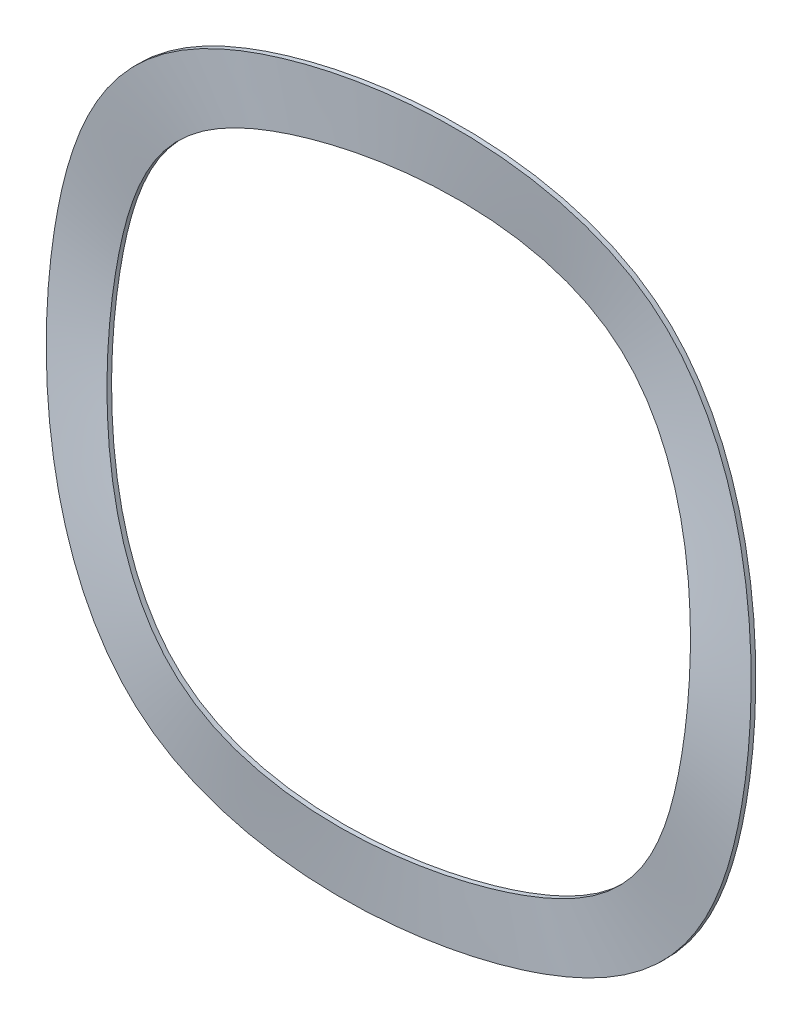
ISO-10303-21;
HEADER;
FILE_DESCRIPTION(('STEP AP214'),'2;1');
FILE_NAME('part.step','',(''),(''),'','','');
FILE_SCHEMA(('AUTOMOTIVE_DESIGN { 1 0 10303 214 1 1 1 1 }'));
ENDSEC;
DATA;
#1=APPLICATION_CONTEXT('core data for automotive mechanical design processes');
#2=APPLICATION_PROTOCOL_DEFINITION('international standard','automotive_design',2000,#1);
#3=PRODUCT_CONTEXT('',#1,'mechanical');
#4=PRODUCT('Part','Part','',(#3));
#5=PRODUCT_RELATED_PRODUCT_CATEGORY('part','',(#4));
#6=PRODUCT_DEFINITION_FORMATION('','',#4);
#7=PRODUCT_DEFINITION_CONTEXT('part definition',#1,'design');
#8=PRODUCT_DEFINITION('design','',#6,#7);
#9=PRODUCT_DEFINITION_SHAPE('','',#8);
#10=(LENGTH_UNIT() NAMED_UNIT(*) SI_UNIT(.MILLI.,.METRE.));
#11=(NAMED_UNIT(*) PLANE_ANGLE_UNIT() SI_UNIT($,.RADIAN.));
#12=(NAMED_UNIT(*) SI_UNIT($,.STERADIAN.) SOLID_ANGLE_UNIT());
#13=UNCERTAINTY_MEASURE_WITH_UNIT(LENGTH_MEASURE(1.E-05),#10,'distance_accuracy_value','');
#14=(GEOMETRIC_REPRESENTATION_CONTEXT(3) GLOBAL_UNCERTAINTY_ASSIGNED_CONTEXT((#13)) GLOBAL_UNIT_ASSIGNED_CONTEXT((#10,
#11,#12)) REPRESENTATION_CONTEXT('',''));
#15=CARTESIAN_POINT('',(0.,0.,0.));
#16=DIRECTION('',(0.,0.,1.));
#17=DIRECTION('',(1.,0.,0.));
#18=AXIS2_PLACEMENT_3D('',#15,#16,#17);
#19=CARTESIAN_POINT('',(4.10424171990796,-11.2763114494309,0.));
#20=CARTESIAN_POINT('',(4.29955316343247,-11.205223897577,-1.30383781570855E-13));
#21=CARTESIAN_POINT('',(4.68607180876146,-11.0517724824196,0.00674999999963001));
#22=CARTESIAN_POINT('',(5.25238003389747,-10.7891453053327,0.0350999999993307));
#23=CARTESIAN_POINT('',(5.80406149847858,-10.4954469538927,0.0796499999990883));
#24=CARTESIAN_POINT('',(9.01944761645147,-8.5551030791188,0.431999999997962));
#25=CARTESIAN_POINT('',(13.8528923057771,-1.59842884244762,2.43000000000089));
#26=CARTESIAN_POINT('',(9.25614157948982,11.0310399809181,-1.34999999999932));
#27=CARTESIAN_POINT('',(-4.92509006391954,13.5315737393022,2.7000000000019));
#28=CARTESIAN_POINT('',(-14.1812316433592,2.50053375843256,-1.35000000000291));
#29=CARTESIAN_POINT('',(-9.58448091711344,-10.1289350649399,2.4299999999972));
#30=CARTESIAN_POINT('',(-1.41018346773691,-12.3511783481163,0.432000000002617));
#31=CARTESIAN_POINT('',(2.30017420164897,-11.7707576341525,0.0796500000013851));
#32=CARTESIAN_POINT('',(2.91157238325626,-11.6411296143023,0.0351000000008826));
#33=CARTESIAN_POINT('',(3.51420314761442,-11.4782977935433,0.00675000000041226));
#34=CARTESIAN_POINT('',(3.90893027638345,-11.3473990012849,1.30457049920792E-13));
#35=CARTESIAN_POINT('',(4.10424171990796,-11.2763114494309,0.));
#36=CARTESIAN_POINT('',(3.87622829102418,-10.6498497022403,0.));
#37=CARTESIAN_POINT('',(4.06068909879732,-10.5827114588227,-1.30383781570855E-13));
#38=CARTESIAN_POINT('',(4.42573448605249,-10.4377851222852,0.00674999999963001));
#39=CARTESIAN_POINT('',(4.96058114312538,-10.1897483439254,0.0350999999993307));
#40=CARTESIAN_POINT('',(5.48161363745199,-9.9123665675653,0.0796499999990883));
#41=CARTESIAN_POINT('',(8.51836719331527,-8.07981957472331,0.431999999997962));
#42=CARTESIAN_POINT('',(13.0832871776784,-1.50962724008942,2.43000000000089));
#43=CARTESIAN_POINT('',(8.74191149174041,10.4182044264226,-1.34999999999932));
#44=CARTESIAN_POINT('',(-4.65147394925743,12.7798196426743,2.7000000000019));
#45=CARTESIAN_POINT('',(-13.3933854409503,2.36161521629742,-1.35000000000291));
#46=CARTESIAN_POINT('',(-9.05200975505158,-9.566216450221,2.4299999999972));
#47=CARTESIAN_POINT('',(-1.33183994175152,-11.6650017732209,0.432000000002617));
#48=CARTESIAN_POINT('',(2.1723867460018,-11.1168266544773,0.0796500000013851));
#49=CARTESIAN_POINT('',(2.74981836196424,-10.9944001912855,0.0351000000008826));
#50=CARTESIAN_POINT('',(3.31896963941361,-10.8406145827909,0.00675000000041226));
#51=CARTESIAN_POINT('',(3.69176748325103,-10.7169879456579,1.30457049920792E-13));
#52=CARTESIAN_POINT('',(3.87622829102418,-10.6498497022403,0.));
#53=CARTESIAN_POINT('',(3.6482148621404,-10.0233879550497,0.));
#54=CARTESIAN_POINT('',(3.82182503416219,-9.96019902006843,-1.3038208750496E-13));
#55=CARTESIAN_POINT('',(4.16539716334352,-9.82379776215076,0.00674999999963003));
#56=CARTESIAN_POINT('',(4.6687822523533,-9.59035138251799,0.0350999999993308));
#57=CARTESIAN_POINT('',(5.1591657764254,-9.32928618123793,0.0796499999990884));
#58=CARTESIAN_POINT('',(8.01728677017907,-7.60453607032782,0.431999999997962));
#59=CARTESIAN_POINT('',(12.3136820495797,-1.42082563773122,2.43000000000089));
#60=CARTESIAN_POINT('',(8.22768140399101,9.80536887192717,-1.34999999999932));
#61=CARTESIAN_POINT('',(-4.37785783459533,12.0280655460463,2.7000000000019));
#62=CARTESIAN_POINT('',(-12.6055392385414,2.22269667416229,-1.35000000000291));
#63=CARTESIAN_POINT('',(-8.51953859298972,-9.00349783550212,2.4299999999972));
#64=CARTESIAN_POINT('',(-1.25349641576614,-10.9788251983256,0.432000000002617));
#65=CARTESIAN_POINT('',(2.04459929035463,-10.4628956748022,0.0796500000013851));
#66=CARTESIAN_POINT('',(2.58806434067223,-10.3476707682687,0.0351000000008825));
#67=CARTESIAN_POINT('',(3.12373613121281,-10.2029313720385,0.00675000000041222));
#68=CARTESIAN_POINT('',(3.47460469011862,-10.086576890031,1.30438415195952E-13));
#69=CARTESIAN_POINT('',(3.6482148621404,-10.0233879550497,0.));
#70=CARTESIAN_POINT('',(3.42020143325662,-9.39692620785911,0.));
#71=CARTESIAN_POINT('',(3.58296096952704,-9.33768658131415,-1.3038208750496E-13));
#72=CARTESIAN_POINT('',(3.90505984063454,-9.20981040201634,0.00674999999963003));
#73=CARTESIAN_POINT('',(4.37698336158121,-8.99095442111061,0.0350999999993308));
#74=CARTESIAN_POINT('',(4.8367179153988,-8.74620579491056,0.0796499999990884));
#75=CARTESIAN_POINT('',(7.51620634704288,-7.12925256593233,0.431999999997962));
#76=CARTESIAN_POINT('',(11.5440769214809,-1.33202403537302,2.43000000000089));
#77=CARTESIAN_POINT('',(7.71345131624161,9.19253331743173,-1.34999999999932));
#78=CARTESIAN_POINT('',(-4.10424171993323,11.2763114494184,2.7000000000019));
#79=CARTESIAN_POINT('',(-11.8176930361326,2.08377813202716,-1.35000000000291));
#80=CARTESIAN_POINT('',(-7.98706743092786,-8.44077922078324,2.4299999999972));
#81=CARTESIAN_POINT('',(-1.17515288978076,-10.2926486234302,0.432000000002617));
#82=CARTESIAN_POINT('',(1.91681183470747,-9.80896469512705,0.0796500000013851));
#83=CARTESIAN_POINT('',(2.42631031938021,-9.7009413452519,0.0351000000008825));
#84=CARTESIAN_POINT('',(2.928502623012,-9.56524816128607,0.00675000000041222));
#85=CARTESIAN_POINT('',(3.2574418969862,-9.45616583440406,1.30438415195952E-13));
#86=CARTESIAN_POINT('',(3.42020143325662,-9.39692620785911,0.));
#87=B_SPLINE_SURFACE_WITH_KNOTS('',3,3,((#19,#20,#21,#22,#23,#24,#25,#26,#27,#28,#29,#30,#31,
#32,#33,#34,#35),(#36,#37,#38,#39,#40,#41,#42,#43,#44,#45,#46,#47,#48,#49,#50,#51,#52),(#53,#54,
#55,#56,#57,#58,#59,#60,#61,#62,#63,#64,#65,#66,#67,#68,#69),(#70,#71,#72,#73,#74,#75,#76,#77,
#78,#79,#80,#81,#82,#83,#84,#85,#86)),.UNSPECIFIED.,.F.,.T.,.F.,(4,4),(4,1,1,1,1,1,1,1,1,1,1,1,
1,1,4),(0.,1.),(0.,0.0083333333333333,0.0166666666666668,0.0250000000000001,0.0333333333333337,
0.166666666666674,0.333333333333348,0.50000000000004,0.666666666667411,0.833333333334139,
0.966666666666667,0.975,0.983333333333334,0.991666666666667,1.),.UNSPECIFIED.);
#88=CARTESIAN_POINT('',(4.10424171990796,-11.2763114494309,0.));
#89=CARTESIAN_POINT('',(4.29955316343247,-11.205223897577,-1.30383781570855E-13));
#90=CARTESIAN_POINT('',(4.68607180876146,-11.0517724824196,0.00674999999963001));
#91=CARTESIAN_POINT('',(5.25238003389747,-10.7891453053327,0.0350999999993307));
#92=CARTESIAN_POINT('',(5.80406149847858,-10.4954469538927,0.0796499999990883));
#93=CARTESIAN_POINT('',(9.01944761645147,-8.5551030791188,0.431999999997962));
#94=CARTESIAN_POINT('',(13.8528923057771,-1.59842884244762,2.43000000000089));
#95=CARTESIAN_POINT('',(9.25614157948982,11.0310399809181,-1.34999999999932));
#96=CARTESIAN_POINT('',(-4.92509006391954,13.5315737393022,2.7000000000019));
#97=CARTESIAN_POINT('',(-14.1812316433592,2.50053375843256,-1.35000000000291));
#98=CARTESIAN_POINT('',(-9.58448091711344,-10.1289350649399,2.4299999999972));
#99=CARTESIAN_POINT('',(-1.41018346773691,-12.3511783481163,0.432000000002617));
#100=CARTESIAN_POINT('',(2.30017420164897,-11.7707576341525,0.0796500000013851));
#101=CARTESIAN_POINT('',(2.91157238325626,-11.6411296143023,0.0351000000008826));
#102=CARTESIAN_POINT('',(3.51420314761442,-11.4782977935433,0.00675000000041226));
#103=CARTESIAN_POINT('',(3.90893027638345,-11.3473990012849,1.30457049920792E-13));
#104=CARTESIAN_POINT('',(4.10424171990796,-11.2763114494309,0.));
#105=B_SPLINE_CURVE_WITH_KNOTS('',3,(#88,#89,#90,#91,#92,#93,#94,#95,#96,#97,#98,#99,#100,#101,
#102,#103,#104),.UNSPECIFIED.,.T.,.F.,(4,1,1,1,1,1,1,1,1,1,1,1,1,1,4),(0.,0.0083333333333333,
0.0166666666666668,0.0250000000000001,0.0333333333333337,0.166666666666674,0.333333333333348,
0.50000000000004,0.666666666667411,0.833333333334139,0.966666666666667,0.975,0.983333333333334,
0.991666666666667,1.),.UNSPECIFIED.);
#106=CARTESIAN_POINT('',(4.10424171990796,-11.2763114494309,0.));
#107=VERTEX_POINT('',#106);
#108=EDGE_CURVE('E11',#107,#107,#105,.F.);
#109=CARTESIAN_POINT('',(3.42020143325662,-9.39692620785911,0.));
#110=CARTESIAN_POINT('',(3.58296096952704,-9.33768658131415,-1.3038208750496E-13));
#111=CARTESIAN_POINT('',(3.90505984063454,-9.20981040201634,0.00674999999963003));
#112=CARTESIAN_POINT('',(4.37698336158121,-8.99095442111061,0.0350999999993308));
#113=CARTESIAN_POINT('',(4.8367179153988,-8.74620579491056,0.0796499999990884));
#114=CARTESIAN_POINT('',(7.51620634704288,-7.12925256593233,0.431999999997962));
#115=CARTESIAN_POINT('',(11.5440769214809,-1.33202403537302,2.43000000000089));
#116=CARTESIAN_POINT('',(7.71345131624161,9.19253331743173,-1.34999999999932));
#117=CARTESIAN_POINT('',(-4.10424171993323,11.2763114494184,2.7000000000019));
#118=CARTESIAN_POINT('',(-11.8176930361326,2.08377813202716,-1.35000000000291));
#119=CARTESIAN_POINT('',(-7.98706743092786,-8.44077922078324,2.4299999999972));
#120=CARTESIAN_POINT('',(-1.17515288978076,-10.2926486234302,0.432000000002617));
#121=CARTESIAN_POINT('',(1.91681183470747,-9.80896469512705,0.0796500000013851));
#122=CARTESIAN_POINT('',(2.42631031938021,-9.7009413452519,0.0351000000008825));
#123=CARTESIAN_POINT('',(2.928502623012,-9.56524816128607,0.00675000000041222));
#124=CARTESIAN_POINT('',(3.2574418969862,-9.45616583440406,1.30438415195952E-13));
#125=CARTESIAN_POINT('',(3.42020143325662,-9.39692620785911,0.));
#126=B_SPLINE_CURVE_WITH_KNOTS('',3,(#109,#110,#111,#112,#113,#114,#115,#116,#117,#118,#119,
#120,#121,#122,#123,#124,#125),.UNSPECIFIED.,.T.,.F.,(4,1,1,1,1,1,1,1,1,1,1,1,1,1,4),(0.,
0.0083333333333333,0.0166666666666668,0.0250000000000001,0.0333333333333337,0.166666666666674,
0.333333333333348,0.50000000000004,0.666666666667411,0.833333333334139,0.966666666666667,0.975,
0.983333333333334,0.991666666666667,1.),.UNSPECIFIED.);
#127=CARTESIAN_POINT('',(3.42020143325662,-9.39692620785911,0.));
#128=VERTEX_POINT('',#127);
#129=EDGE_CURVE('E63',#128,#128,#126,.T.);
#130=ORIENTED_EDGE('',*,*,#108,.T.);
#131=EDGE_LOOP('',(#130));
#132=FACE_BOUND('',#131,.T.);
#133=ORIENTED_EDGE('',*,*,#129,.T.);
#134=EDGE_LOOP('',(#133));
#135=FACE_BOUND('',#134,.T.);
#136=ADVANCED_FACE('F51',(#132,#135),#87,.T.);
#137=CARTESIAN_POINT('',(4.10424171990796,-11.2763114494309,0.15));
#138=CARTESIAN_POINT('',(4.29955316343247,-11.205223897577,0.14999999999987));
#139=CARTESIAN_POINT('',(4.68607180876146,-11.0517724824196,0.15674999999963));
#140=CARTESIAN_POINT('',(5.25238003389747,-10.7891453053327,0.185099999999331));
#141=CARTESIAN_POINT('',(5.80406149847858,-10.4954469538927,0.229649999999088));
#142=CARTESIAN_POINT('',(9.01944761645146,-8.5551030791188,0.581999999997962));
#143=CARTESIAN_POINT('',(13.8528923057771,-1.59842884244763,2.58000000000088));
#144=CARTESIAN_POINT('',(9.25614157948994,11.0310399809181,-1.19999999999932));
#145=CARTESIAN_POINT('',(-4.92509006391999,13.531573739302,2.8500000000019));
#146=CARTESIAN_POINT('',(-14.1812316433591,2.5005337584326,-1.20000000000291));
#147=CARTESIAN_POINT('',(-9.58448091711347,-10.1289350649399,2.5799999999972));
#148=CARTESIAN_POINT('',(-1.41018346773691,-12.3511783481163,0.582000000002617));
#149=CARTESIAN_POINT('',(2.30017420164897,-11.7707576341525,0.229650000001385));
#150=CARTESIAN_POINT('',(2.91157238325626,-11.6411296143023,0.185100000000882));
#151=CARTESIAN_POINT('',(3.51420314761442,-11.4782977935433,0.156750000000412));
#152=CARTESIAN_POINT('',(3.90893027638345,-11.3473990012849,0.15000000000013));
#153=CARTESIAN_POINT('',(4.10424171990796,-11.2763114494309,0.15));
#154=CARTESIAN_POINT('',(4.10424171990796,-11.2763114494309,0.1375));
#155=CARTESIAN_POINT('',(4.29955316343247,-11.205223897577,0.13749999999987));
#156=CARTESIAN_POINT('',(4.68607180876146,-11.0517724824196,0.14424999999963));
#157=CARTESIAN_POINT('',(5.25238003389747,-10.7891453053327,0.172599999999331));
#158=CARTESIAN_POINT('',(5.80406149847858,-10.4954469538927,0.217149999999088));
#159=CARTESIAN_POINT('',(9.01944761645146,-8.5551030791188,0.569499999997962));
#160=CARTESIAN_POINT('',(13.8528923057771,-1.59842884244763,2.56750000000088));
#161=CARTESIAN_POINT('',(9.25614157948993,11.0310399809181,-1.21249999999932));
#162=CARTESIAN_POINT('',(-4.92509006391995,13.531573739302,2.8375000000019));
#163=CARTESIAN_POINT('',(-14.1812316433591,2.5005337584326,-1.21250000000291));
#164=CARTESIAN_POINT('',(-9.58448091711347,-10.1289350649399,2.5674999999972));
#165=CARTESIAN_POINT('',(-1.41018346773691,-12.3511783481163,0.569500000002617));
#166=CARTESIAN_POINT('',(2.30017420164897,-11.7707576341525,0.217150000001385));
#167=CARTESIAN_POINT('',(2.91157238325626,-11.6411296143023,0.172600000000883));
#168=CARTESIAN_POINT('',(3.51420314761442,-11.4782977935433,0.144250000000412));
#169=CARTESIAN_POINT('',(3.90893027638345,-11.3473990012849,0.13750000000013));
#170=CARTESIAN_POINT('',(4.10424171990796,-11.2763114494309,0.1375));
#171=CARTESIAN_POINT('',(4.10424171990796,-11.2763114494309,0.1125));
#172=CARTESIAN_POINT('',(4.29955316343246,-11.205223897577,0.112499999999869));
#173=CARTESIAN_POINT('',(4.68607180876146,-11.0517724824196,0.11924999999963));
#174=CARTESIAN_POINT('',(5.25238003389747,-10.7891453053327,0.147599999999331));
#175=CARTESIAN_POINT('',(5.80406149847858,-10.4954469538927,0.192149999999088));
#176=CARTESIAN_POINT('',(9.01944761645147,-8.5551030791188,0.544499999997962));
#177=CARTESIAN_POINT('',(13.8528923057771,-1.59842884244763,2.54250000000089));
#178=CARTESIAN_POINT('',(9.25614157948989,11.0310399809181,-1.23749999999932));
#179=CARTESIAN_POINT('',(-4.92509006391986,13.5315737393021,2.8125000000019));
#180=CARTESIAN_POINT('',(-14.1812316433591,2.50053375843259,-1.23750000000291));
#181=CARTESIAN_POINT('',(-9.58448091711347,-10.1289350649399,2.5424999999972));
#182=CARTESIAN_POINT('',(-1.41018346773691,-12.3511783481163,0.544500000002617));
#183=CARTESIAN_POINT('',(2.30017420164897,-11.7707576341525,0.192150000001385));
#184=CARTESIAN_POINT('',(2.91157238325626,-11.6411296143023,0.147600000000882));
#185=CARTESIAN_POINT('',(3.51420314761442,-11.4782977935433,0.119250000000412));
#186=CARTESIAN_POINT('',(3.90893027638345,-11.3473990012849,0.11250000000013));
#187=CARTESIAN_POINT('',(4.10424171990796,-11.2763114494309,0.1125));
#188=CARTESIAN_POINT('',(4.10424171990796,-11.2763114494309,0.0750000000000003));
#189=CARTESIAN_POINT('',(4.29955316343247,-11.205223897577,0.0749999999998699));
#190=CARTESIAN_POINT('',(4.68607180876146,-11.0517724824196,0.0817499999996303));
#191=CARTESIAN_POINT('',(5.25238003389747,-10.7891453053327,0.110099999999331));
#192=CARTESIAN_POINT('',(5.80406149847858,-10.4954469538927,0.154649999999089));
#193=CARTESIAN_POINT('',(9.01944761645147,-8.5551030791188,0.506999999997962));
#194=CARTESIAN_POINT('',(13.8528923057771,-1.59842884244762,2.50500000000089));
#195=CARTESIAN_POINT('',(9.2561415794899,11.0310399809181,-1.27499999999932));
#196=CARTESIAN_POINT('',(-4.92509006391978,13.5315737393021,2.7750000000019));
#197=CARTESIAN_POINT('',(-14.1812316433591,2.50053375843258,-1.27500000000291));
#198=CARTESIAN_POINT('',(-9.58448091711345,-10.1289350649399,2.5049999999972));
#199=CARTESIAN_POINT('',(-1.41018346773691,-12.3511783481163,0.507000000002617));
#200=CARTESIAN_POINT('',(2.30017420164897,-11.7707576341525,0.154650000001385));
#201=CARTESIAN_POINT('',(2.91157238325626,-11.6411296143023,0.110100000000883));
#202=CARTESIAN_POINT('',(3.51420314761442,-11.4782977935433,0.0817500000004125));
#203=CARTESIAN_POINT('',(3.90893027638345,-11.3473990012849,0.0750000000001307));
#204=CARTESIAN_POINT('',(4.10424171990796,-11.2763114494309,0.0750000000000003));
#205=CARTESIAN_POINT('',(4.10424171990796,-11.2763114494309,0.0375000000000001));
#206=CARTESIAN_POINT('',(4.29955316343246,-11.205223897577,0.0374999999998697));
#207=CARTESIAN_POINT('',(4.68607180876146,-11.0517724824196,0.0442499999996301));
#208=CARTESIAN_POINT('',(5.25238003389747,-10.7891453053327,0.0725999999993308));
#209=CARTESIAN_POINT('',(5.80406149847858,-10.4954469538927,0.117149999999088));
#210=CARTESIAN_POINT('',(9.01944761645146,-8.55510307911879,0.469499999997962));
#211=CARTESIAN_POINT('',(13.8528923057771,-1.59842884244764,2.46750000000089));
#212=CARTESIAN_POINT('',(9.25614157948983,11.0310399809181,-1.31249999999932));
#213=CARTESIAN_POINT('',(-4.92509006391964,13.5315737393021,2.7375000000019));
#214=CARTESIAN_POINT('',(-14.1812316433591,2.50053375843257,-1.31250000000291));
#215=CARTESIAN_POINT('',(-9.58448091711345,-10.1289350649399,2.46749999999719));
#216=CARTESIAN_POINT('',(-1.41018346773691,-12.3511783481163,0.469500000002617));
#217=CARTESIAN_POINT('',(2.30017420164897,-11.7707576341524,0.117150000001385));
#218=CARTESIAN_POINT('',(2.91157238325626,-11.6411296143023,0.0726000000008825));
#219=CARTESIAN_POINT('',(3.51420314761442,-11.4782977935433,0.0442500000004122));
#220=CARTESIAN_POINT('',(3.90893027638345,-11.3473990012849,0.0375000000001305));
#221=CARTESIAN_POINT('',(4.10424171990796,-11.2763114494309,0.0375000000000001));
#222=CARTESIAN_POINT('',(4.10424171990796,-11.2763114494309,0.0125000000000001));
#223=CARTESIAN_POINT('',(4.29955316343247,-11.205223897577,0.0124999999998696));
#224=CARTESIAN_POINT('',(4.68607180876146,-11.0517724824196,0.0192499999996301));
#225=CARTESIAN_POINT('',(5.25238003389747,-10.7891453053327,0.0475999999993308));
#226=CARTESIAN_POINT('',(5.80406149847858,-10.4954469538927,0.0921499999990884));
#227=CARTESIAN_POINT('',(9.01944761645147,-8.5551030791188,0.444499999997962));
#228=CARTESIAN_POINT('',(13.8528923057771,-1.59842884244763,2.44250000000089));
#229=CARTESIAN_POINT('',(9.25614157948983,11.0310399809181,-1.33749999999932));
#230=CARTESIAN_POINT('',(-4.92509006391957,13.5315737393022,2.7125000000019));
#231=CARTESIAN_POINT('',(-14.1812316433592,2.50053375843256,-1.33750000000291));
#232=CARTESIAN_POINT('',(-9.58448091711345,-10.1289350649399,2.4424999999972));
#233=CARTESIAN_POINT('',(-1.41018346773691,-12.3511783481163,0.444500000002617));
#234=CARTESIAN_POINT('',(2.30017420164897,-11.7707576341525,0.0921500000013851));
#235=CARTESIAN_POINT('',(2.91157238325626,-11.6411296143023,0.0476000000008826));
#236=CARTESIAN_POINT('',(3.51420314761442,-11.4782977935433,0.0192500000004123));
#237=CARTESIAN_POINT('',(3.90893027638345,-11.3473990012849,0.0125000000001305));
#238=CARTESIAN_POINT('',(4.10424171990796,-11.2763114494309,0.0125000000000001));
#239=CARTESIAN_POINT('',(4.10424171990796,-11.2763114494309,0.));
#240=CARTESIAN_POINT('',(4.29955316343247,-11.205223897577,-1.30383781570855E-13));
#241=CARTESIAN_POINT('',(4.68607180876146,-11.0517724824196,0.00674999999963001));
#242=CARTESIAN_POINT('',(5.25238003389747,-10.7891453053327,0.0350999999993307));
#243=CARTESIAN_POINT('',(5.80406149847858,-10.4954469538927,0.0796499999990883));
#244=CARTESIAN_POINT('',(9.01944761645147,-8.5551030791188,0.431999999997962));
#245=CARTESIAN_POINT('',(13.8528923057771,-1.59842884244762,2.43000000000089));
#246=CARTESIAN_POINT('',(9.25614157948982,11.0310399809181,-1.34999999999932));
#247=CARTESIAN_POINT('',(-4.92509006391954,13.5315737393022,2.7000000000019));
#248=CARTESIAN_POINT('',(-14.1812316433592,2.50053375843256,-1.35000000000291));
#249=CARTESIAN_POINT('',(-9.58448091711344,-10.1289350649399,2.4299999999972));
#250=CARTESIAN_POINT('',(-1.41018346773691,-12.3511783481163,0.432000000002617));
#251=CARTESIAN_POINT('',(2.30017420164897,-11.7707576341525,0.0796500000013851));
#252=CARTESIAN_POINT('',(2.91157238325626,-11.6411296143023,0.0351000000008826));
#253=CARTESIAN_POINT('',(3.51420314761442,-11.4782977935433,0.00675000000041226));
#254=CARTESIAN_POINT('',(3.90893027638345,-11.3473990012849,1.30457049920792E-13));
#255=CARTESIAN_POINT('',(4.10424171990796,-11.2763114494309,0.));
#256=B_SPLINE_SURFACE_WITH_KNOTS('',3,3,((#137,#138,#139,#140,#141,#142,#143,#144,#145,#146,
#147,#148,#149,#150,#151,#152,#153),(#154,#155,#156,#157,#158,#159,#160,#161,#162,#163,#164,
#165,#166,#167,#168,#169,#170),(#171,#172,#173,#174,#175,#176,#177,#178,#179,#180,#181,#182,
#183,#184,#185,#186,#187),(#188,#189,#190,#191,#192,#193,#194,#195,#196,#197,#198,#199,#200,
#201,#202,#203,#204),(#205,#206,#207,#208,#209,#210,#211,#212,#213,#214,#215,#216,#217,#218,
#219,#220,#221),(#222,#223,#224,#225,#226,#227,#228,#229,#230,#231,#232,#233,#234,#235,#236,
#237,#238),(#239,#240,#241,#242,#243,#244,#245,#246,#247,#248,#249,#250,#251,#252,#253,#254,
#255)),.UNSPECIFIED.,.F.,.T.,.F.,(4,1,1,1,4),(4,1,1,1,1,1,1,1,1,1,1,1,1,1,4),(0.934782608695652,
0.951086956521739,0.967391304347826,0.983695652173913,1.),(0.,0.0083333333333333,
0.0166666666666668,0.0250000000000001,0.0333333333333337,0.166666666666674,0.333333333333348,
0.50000000000004,0.666666666667411,0.833333333334139,0.966666666666667,0.975,0.983333333333334,
0.991666666666667,1.),.UNSPECIFIED.);
#257=CARTESIAN_POINT('',(4.10424171990796,-11.2763114494309,0.15));
#258=CARTESIAN_POINT('',(4.29955316343247,-11.205223897577,0.14999999999987));
#259=CARTESIAN_POINT('',(4.68607180876146,-11.0517724824196,0.15674999999963));
#260=CARTESIAN_POINT('',(5.25238003389747,-10.7891453053327,0.185099999999331));
#261=CARTESIAN_POINT('',(5.80406149847858,-10.4954469538927,0.229649999999088));
#262=CARTESIAN_POINT('',(9.01944761645146,-8.5551030791188,0.581999999997962));
#263=CARTESIAN_POINT('',(13.8528923057771,-1.59842884244763,2.58000000000088));
#264=CARTESIAN_POINT('',(9.25614157948994,11.0310399809181,-1.19999999999932));
#265=CARTESIAN_POINT('',(-4.92509006391999,13.531573739302,2.8500000000019));
#266=CARTESIAN_POINT('',(-14.1812316433591,2.5005337584326,-1.20000000000291));
#267=CARTESIAN_POINT('',(-9.58448091711347,-10.1289350649399,2.5799999999972));
#268=CARTESIAN_POINT('',(-1.41018346773691,-12.3511783481163,0.582000000002617));
#269=CARTESIAN_POINT('',(2.30017420164897,-11.7707576341525,0.229650000001385));
#270=CARTESIAN_POINT('',(2.91157238325626,-11.6411296143023,0.185100000000882));
#271=CARTESIAN_POINT('',(3.51420314761442,-11.4782977935433,0.156750000000412));
#272=CARTESIAN_POINT('',(3.90893027638345,-11.3473990012849,0.15000000000013));
#273=CARTESIAN_POINT('',(4.10424171990796,-11.2763114494309,0.15));
#274=B_SPLINE_CURVE_WITH_KNOTS('',3,(#257,#258,#259,#260,#261,#262,#263,#264,#265,#266,#267,
#268,#269,#270,#271,#272,#273),.UNSPECIFIED.,.T.,.F.,(4,1,1,1,1,1,1,1,1,1,1,1,1,1,4),(0.,
0.0083333333333333,0.0166666666666668,0.0250000000000001,0.0333333333333337,0.166666666666674,
0.333333333333348,0.50000000000004,0.666666666667411,0.833333333334139,0.966666666666667,0.975,
0.983333333333334,0.991666666666667,1.),.UNSPECIFIED.);
#275=CARTESIAN_POINT('',(4.10424171990796,-11.2763114494309,0.15));
#276=VERTEX_POINT('',#275);
#277=EDGE_CURVE('E57',#276,#276,#274,.T.);
#278=ORIENTED_EDGE('',*,*,#108,.F.);
#279=EDGE_LOOP('',(#278));
#280=FACE_BOUND('',#279,.T.);
#281=ORIENTED_EDGE('',*,*,#277,.F.);
#282=EDGE_LOOP('',(#281));
#283=FACE_BOUND('',#282,.T.);
#284=ADVANCED_FACE('F53',(#280,#283),#256,.T.);
#285=CARTESIAN_POINT('',(3.42020143325662,-9.39692620785911,0.15));
#286=CARTESIAN_POINT('',(3.58296096952705,-9.33768658131415,0.149999999999869));
#287=CARTESIAN_POINT('',(3.90505984063454,-9.20981040201634,0.15674999999963));
#288=CARTESIAN_POINT('',(4.37698336158121,-8.99095442111061,0.185099999999331));
#289=CARTESIAN_POINT('',(4.83671791539881,-8.74620579491056,0.229649999999088));
#290=CARTESIAN_POINT('',(7.51620634704288,-7.12925256593233,0.581999999997962));
#291=CARTESIAN_POINT('',(11.5440769214809,-1.33202403537302,2.58000000000089));
#292=CARTESIAN_POINT('',(7.7134513162416,9.19253331743173,-1.19999999999932));
#293=CARTESIAN_POINT('',(-4.10424171993323,11.2763114494184,2.8500000000019));
#294=CARTESIAN_POINT('',(-11.8176930361326,2.08377813202716,-1.20000000000291));
#295=CARTESIAN_POINT('',(-7.98706743092786,-8.44077922078324,2.5799999999972));
#296=CARTESIAN_POINT('',(-1.17515288978076,-10.2926486234302,0.582000000002617));
#297=CARTESIAN_POINT('',(1.91681183470747,-9.80896469512705,0.229650000001385));
#298=CARTESIAN_POINT('',(2.42631031938021,-9.7009413452519,0.185100000000882));
#299=CARTESIAN_POINT('',(2.92850262301201,-9.56524816128607,0.156750000000412));
#300=CARTESIAN_POINT('',(3.2574418969862,-9.45616583440406,0.15000000000013));
#301=CARTESIAN_POINT('',(3.42020143325662,-9.39692620785911,0.15));
#302=CARTESIAN_POINT('',(3.47720479047757,-9.55354164465676,0.15));
#303=CARTESIAN_POINT('',(3.64267698568583,-9.49331469100272,0.14999999999987));
#304=CARTESIAN_POINT('',(3.97014417131179,-9.36330724204995,0.15674999999963));
#305=CARTESIAN_POINT('',(4.44993308427423,-9.14080366146246,0.185099999999331));
#306=CARTESIAN_POINT('',(4.91732988065545,-8.8919758914924,0.229649999999088));
#307=CARTESIAN_POINT('',(7.64147645282693,-7.24807344203121,0.581999999997962));
#308=CARTESIAN_POINT('',(11.7364782035056,-1.35422443596257,2.58000000000089));
#309=CARTESIAN_POINT('',(7.84200883817897,9.34574220605559,-1.19999999999932));
#310=CARTESIAN_POINT('',(-4.1726457485988,11.4642499735754,2.8500000000019));
#311=CARTESIAN_POINT('',(-12.0146545867348,2.11850776756095,-1.20000000000291));
#312=CARTESIAN_POINT('',(-8.12018522144333,-8.58145887446296,2.5799999999972));
#313=CARTESIAN_POINT('',(-1.1947387712771,-10.4641927671541,0.582000000002617));
#314=CARTESIAN_POINT('',(1.94875869861926,-9.97244744004583,0.229650000001385));
#315=CARTESIAN_POINT('',(2.46674882470321,-9.8626237010061,0.185100000000882));
#316=CARTESIAN_POINT('',(2.97731100006221,-9.72466896397418,0.156750000000412));
#317=CARTESIAN_POINT('',(3.31173259526931,-9.6137685983108,0.15000000000013));
#318=CARTESIAN_POINT('',(3.47720479047757,-9.55354164465676,0.15));
#319=CARTESIAN_POINT('',(3.59121150491946,-9.86677251825208,0.15));
#320=CARTESIAN_POINT('',(3.7621090180034,-9.80457091037987,0.14999999999987));
#321=CARTESIAN_POINT('',(4.10031283266628,-9.67030092211717,0.15674999999963));
#322=CARTESIAN_POINT('',(4.59583252966028,-9.44050214216615,0.185099999999331));
#323=CARTESIAN_POINT('',(5.07855381116875,-9.1835160846561,0.229649999999089));
#324=CARTESIAN_POINT('',(7.89201666439503,-7.48571519422896,0.581999999997962));
#325=CARTESIAN_POINT('',(12.121280767555,-1.39862523714167,2.58000000000089));
#326=CARTESIAN_POINT('',(8.09912388205367,9.65215998330333,-1.19999999999932));
#327=CARTESIAN_POINT('',(-4.30945380592991,11.8401270218893,2.8500000000019));
#328=CARTESIAN_POINT('',(-12.4085776879392,2.18796703862853,-1.20000000000291));
#329=CARTESIAN_POINT('',(-8.38642080247426,-8.86281818182242,2.5799999999972));
#330=CARTESIAN_POINT('',(-1.2339105342698,-10.8072810546018,0.582000000002618));
#331=CARTESIAN_POINT('',(2.01265242644285,-10.2994129298834,0.229650000001385));
#332=CARTESIAN_POINT('',(2.54762583534922,-10.1859884125145,0.185100000000883));
#333=CARTESIAN_POINT('',(3.07492775416261,-10.0435105693504,0.156750000000413));
#334=CARTESIAN_POINT('',(3.42031399183552,-9.92897412612428,0.150000000000131));
#335=CARTESIAN_POINT('',(3.59121150491946,-9.86677251825208,0.15));
#336=CARTESIAN_POINT('',(3.76222157658229,-10.336618828645,0.15));
#337=CARTESIAN_POINT('',(3.94125706647975,-10.2714552394456,0.149999999999869));
#338=CARTESIAN_POINT('',(4.295565824698,-10.130791442218,0.15674999999963));
#339=CARTESIAN_POINT('',(4.81468169773934,-9.89004986322166,0.185099999999331));
#340=CARTESIAN_POINT('',(5.32038970693869,-9.6208263744016,0.229649999999088));
#341=CARTESIAN_POINT('',(8.26782698174716,-7.84217782252556,0.581999999997962));
#342=CARTESIAN_POINT('',(12.698484613629,-1.46522643891033,2.58000000000088));
#343=CARTESIAN_POINT('',(8.48479644786579,10.1117866491749,-1.19999999999932));
#344=CARTESIAN_POINT('',(-4.51466589192662,12.4039425943602,2.8500000000019));
#345=CARTESIAN_POINT('',(-12.9994623397458,2.29215594522988,-1.20000000000291));
#346=CARTESIAN_POINT('',(-8.78577417402068,-9.28485714286156,2.57999999999719));
#347=CARTESIAN_POINT('',(-1.29266817875884,-11.3219134857733,0.582000000002615));
#348=CARTESIAN_POINT('',(2.10849301817822,-10.7898611646397,0.229650000001384));
#349=CARTESIAN_POINT('',(2.66894135131823,-10.6710354797771,0.185100000000882));
#350=CARTESIAN_POINT('',(3.22135288531321,-10.5217729774147,0.156750000000412));
#351=CARTESIAN_POINT('',(3.58318608668482,-10.4017824178445,0.15000000000013));
#352=CARTESIAN_POINT('',(3.76222157658229,-10.336618828645,0.15));
#353=CARTESIAN_POINT('',(3.93323164824513,-10.806465139038,0.15));
#354=CARTESIAN_POINT('',(4.12040511495611,-10.7383395685113,0.14999999999987));
#355=CARTESIAN_POINT('',(4.49081881672974,-10.5912819623188,0.15674999999963));
#356=CARTESIAN_POINT('',(5.03353086581841,-10.3395975842772,0.185099999999331));
#357=CARTESIAN_POINT('',(5.56222560270864,-10.0581366641472,0.229649999999088));
#358=CARTESIAN_POINT('',(8.64363729909933,-8.19864045082219,0.581999999997961));
#359=CARTESIAN_POINT('',(13.2756884597031,-1.53182764067898,2.58000000000089));
#360=CARTESIAN_POINT('',(8.87046901367784,10.5714133150465,-1.19999999999932));
#361=CARTESIAN_POINT('',(-4.71987797792329,12.9677581668311,2.8500000000019));
#362=CARTESIAN_POINT('',(-13.5903469915525,2.39634485183124,-1.20000000000291));
#363=CARTESIAN_POINT('',(-9.18512754556705,-9.70689610390072,2.5799999999972));
#364=CARTESIAN_POINT('',(-1.35142582324787,-11.8365459169448,0.582000000002618));
#365=CARTESIAN_POINT('',(2.2043336099136,-11.2803093993961,0.229650000001386));
#366=CARTESIAN_POINT('',(2.79025686728725,-11.1560825470397,0.185100000000883));
#367=CARTESIAN_POINT('',(3.36777801646382,-11.000035385479,0.156750000000412));
#368=CARTESIAN_POINT('',(3.74605818153414,-10.8745907095647,0.150000000000131));
#369=CARTESIAN_POINT('',(3.93323164824513,-10.806465139038,0.15));
#370=CARTESIAN_POINT('',(4.04723836268701,-11.1196960126333,0.15));
#371=CARTESIAN_POINT('',(4.23983714727368,-11.0495957878884,0.14999999999987));
#372=CARTESIAN_POINT('',(4.62098747808422,-10.898275642386,0.15674999999963));
#373=CARTESIAN_POINT('',(5.17943031120445,-10.6392960649809,0.185099999999331));
#374=CARTESIAN_POINT('',(5.72344953322193,-10.3496768573108,0.229649999999088));
#375=CARTESIAN_POINT('',(8.89417751066742,-8.43628220301993,0.581999999997962));
#376=CARTESIAN_POINT('',(13.6604910237524,-1.57622844185808,2.58000000000089));
#377=CARTESIAN_POINT('',(9.12758405755258,10.8778310922942,-1.19999999999932));
#378=CARTESIAN_POINT('',(-4.85668603525442,13.3436352151451,2.8500000000019));
#379=CARTESIAN_POINT('',(-13.9842700927569,2.46580412289882,-1.20000000000291));
#380=CARTESIAN_POINT('',(-9.451363126598,-9.98825541126017,2.5799999999972));
#381=CARTESIAN_POINT('',(-1.39059758624056,-12.1796342043925,0.582000000002617));
#382=CARTESIAN_POINT('',(2.26822733773718,-11.6072748892337,0.229650000001385));
#383=CARTESIAN_POINT('',(2.87113387793326,-11.4794472585481,0.185100000000883));
#384=CARTESIAN_POINT('',(3.46539477056422,-11.3188769908552,0.156750000000412));
#385=CARTESIAN_POINT('',(3.85463957810035,-11.1897962373781,0.150000000000131));
#386=CARTESIAN_POINT('',(4.04723836268701,-11.1196960126333,0.15));
#387=CARTESIAN_POINT('',(4.10424171990796,-11.2763114494309,0.15));
#388=CARTESIAN_POINT('',(4.29955316343247,-11.205223897577,0.14999999999987));
#389=CARTESIAN_POINT('',(4.68607180876146,-11.0517724824196,0.15674999999963));
#390=CARTESIAN_POINT('',(5.25238003389747,-10.7891453053327,0.185099999999331));
#391=CARTESIAN_POINT('',(5.80406149847858,-10.4954469538927,0.229649999999088));
#392=CARTESIAN_POINT('',(9.01944761645146,-8.5551030791188,0.581999999997962));
#393=CARTESIAN_POINT('',(13.8528923057771,-1.59842884244763,2.58000000000088));
#394=CARTESIAN_POINT('',(9.25614157948994,11.0310399809181,-1.19999999999932));
#395=CARTESIAN_POINT('',(-4.92509006391999,13.531573739302,2.8500000000019));
#396=CARTESIAN_POINT('',(-14.1812316433591,2.5005337584326,-1.20000000000291));
#397=CARTESIAN_POINT('',(-9.58448091711347,-10.1289350649399,2.5799999999972));
#398=CARTESIAN_POINT('',(-1.41018346773691,-12.3511783481163,0.582000000002617));
#399=CARTESIAN_POINT('',(2.30017420164897,-11.7707576341525,0.229650000001385));
#400=CARTESIAN_POINT('',(2.91157238325626,-11.6411296143023,0.185100000000882));
#401=CARTESIAN_POINT('',(3.51420314761442,-11.4782977935433,0.156750000000412));
#402=CARTESIAN_POINT('',(3.90893027638345,-11.3473990012849,0.15000000000013));
#403=CARTESIAN_POINT('',(4.10424171990796,-11.2763114494309,0.15));
#404=B_SPLINE_SURFACE_WITH_KNOTS('',3,3,((#285,#286,#287,#288,#289,#290,#291,#292,#293,#294,
#295,#296,#297,#298,#299,#300,#301),(#302,#303,#304,#305,#306,#307,#308,#309,#310,#311,#312,
#313,#314,#315,#316,#317,#318),(#319,#320,#321,#322,#323,#324,#325,#326,#327,#328,#329,#330,
#331,#332,#333,#334,#335),(#336,#337,#338,#339,#340,#341,#342,#343,#344,#345,#346,#347,#348,
#349,#350,#351,#352),(#353,#354,#355,#356,#357,#358,#359,#360,#361,#362,#363,#364,#365,#366,
#367,#368,#369),(#370,#371,#372,#373,#374,#375,#376,#377,#378,#379,#380,#381,#382,#383,#384,
#385,#386),(#387,#388,#389,#390,#391,#392,#393,#394,#395,#396,#397,#398,#399,#400,#401,#402,
#403)),.UNSPECIFIED.,.F.,.T.,.F.,(4,1,1,1,4),(4,1,1,1,1,1,1,1,1,1,1,1,1,1,4),(0.065217391304348,
0.282608695652174,0.5,0.717391304347826,0.934782608695652),(0.,0.0083333333333333,
0.0166666666666668,0.0250000000000001,0.0333333333333337,0.166666666666674,0.333333333333348,
0.50000000000004,0.666666666667411,0.833333333334139,0.966666666666667,0.975,0.983333333333334,
0.991666666666667,1.),.UNSPECIFIED.);
#405=CARTESIAN_POINT('',(3.42020143325662,-9.39692620785911,0.15));
#406=CARTESIAN_POINT('',(3.58296096952705,-9.33768658131415,0.149999999999869));
#407=CARTESIAN_POINT('',(3.90505984063454,-9.20981040201634,0.15674999999963));
#408=CARTESIAN_POINT('',(4.37698336158121,-8.99095442111061,0.185099999999331));
#409=CARTESIAN_POINT('',(4.83671791539881,-8.74620579491056,0.229649999999088));
#410=CARTESIAN_POINT('',(7.51620634704288,-7.12925256593233,0.581999999997962));
#411=CARTESIAN_POINT('',(11.5440769214809,-1.33202403537302,2.58000000000089));
#412=CARTESIAN_POINT('',(7.7134513162416,9.19253331743173,-1.19999999999932));
#413=CARTESIAN_POINT('',(-4.10424171993323,11.2763114494184,2.8500000000019));
#414=CARTESIAN_POINT('',(-11.8176930361326,2.08377813202716,-1.20000000000291));
#415=CARTESIAN_POINT('',(-7.98706743092786,-8.44077922078324,2.5799999999972));
#416=CARTESIAN_POINT('',(-1.17515288978076,-10.2926486234302,0.582000000002617));
#417=CARTESIAN_POINT('',(1.91681183470747,-9.80896469512705,0.229650000001385));
#418=CARTESIAN_POINT('',(2.42631031938021,-9.7009413452519,0.185100000000882));
#419=CARTESIAN_POINT('',(2.92850262301201,-9.56524816128607,0.156750000000412));
#420=CARTESIAN_POINT('',(3.2574418969862,-9.45616583440406,0.15000000000013));
#421=CARTESIAN_POINT('',(3.42020143325662,-9.39692620785911,0.15));
#422=B_SPLINE_CURVE_WITH_KNOTS('',3,(#405,#406,#407,#408,#409,#410,#411,#412,#413,#414,#415,
#416,#417,#418,#419,#420,#421),.UNSPECIFIED.,.T.,.F.,(4,1,1,1,1,1,1,1,1,1,1,1,1,1,4),(0.,
0.0083333333333333,0.0166666666666668,0.0250000000000001,0.0333333333333337,0.166666666666674,
0.333333333333348,0.50000000000004,0.666666666667411,0.833333333334139,0.966666666666667,0.975,
0.983333333333334,0.991666666666667,1.),.UNSPECIFIED.);
#423=CARTESIAN_POINT('',(3.42020143325662,-9.39692620785911,0.15));
#424=VERTEX_POINT('',#423);
#425=EDGE_CURVE('E76',#424,#424,#422,.T.);
#426=ORIENTED_EDGE('',*,*,#277,.T.);
#427=EDGE_LOOP('',(#426));
#428=FACE_BOUND('',#427,.T.);
#429=ORIENTED_EDGE('',*,*,#425,.F.);
#430=EDGE_LOOP('',(#429));
#431=FACE_BOUND('',#430,.T.);
#432=ADVANCED_FACE('F91',(#428,#431),#404,.T.);
#433=CARTESIAN_POINT('',(3.42020143325662,-9.39692620785911,0.));
#434=CARTESIAN_POINT('',(3.58296096952704,-9.33768658131415,-1.30434603547689E-13));
#435=CARTESIAN_POINT('',(3.90505984063454,-9.20981040201634,0.00674999999962998));
#436=CARTESIAN_POINT('',(4.37698336158121,-8.99095442111061,0.0350999999993307));
#437=CARTESIAN_POINT('',(4.8367179153988,-8.74620579491056,0.0796499999990884));
#438=CARTESIAN_POINT('',(7.51620634704288,-7.12925256593233,0.431999999997962));
#439=CARTESIAN_POINT('',(11.5440769214809,-1.33202403537302,2.43000000000089));
#440=CARTESIAN_POINT('',(7.71345131624161,9.19253331743173,-1.34999999999932));
#441=CARTESIAN_POINT('',(-4.10424171993323,11.2763114494184,2.7000000000019));
#442=CARTESIAN_POINT('',(-11.8176930361326,2.08377813202716,-1.35000000000291));
#443=CARTESIAN_POINT('',(-7.98706743092786,-8.44077922078324,2.4299999999972));
#444=CARTESIAN_POINT('',(-1.17515288978076,-10.2926486234302,0.432000000002617));
#445=CARTESIAN_POINT('',(1.91681183470747,-9.80896469512705,0.079650000001385));
#446=CARTESIAN_POINT('',(2.42631031938021,-9.7009413452519,0.0351000000008824));
#447=CARTESIAN_POINT('',(2.92850262301201,-9.56524816128607,0.00675000000041216));
#448=CARTESIAN_POINT('',(3.2574418969862,-9.45616583440406,1.30380393439066E-13));
#449=CARTESIAN_POINT('',(3.42020143325662,-9.39692620785911,0.));
#450=CARTESIAN_POINT('',(3.42020143325662,-9.39692620785911,0.0125));
#451=CARTESIAN_POINT('',(3.58296096952704,-9.33768658131415,0.0124999999998696));
#452=CARTESIAN_POINT('',(3.90505984063454,-9.20981040201634,0.01924999999963));
#453=CARTESIAN_POINT('',(4.37698336158121,-8.99095442111061,0.0475999999993308));
#454=CARTESIAN_POINT('',(4.8367179153988,-8.74620579491056,0.0921499999990884));
#455=CARTESIAN_POINT('',(7.51620634704288,-7.12925256593233,0.444499999997962));
#456=CARTESIAN_POINT('',(11.5440769214809,-1.33202403537302,2.44250000000089));
#457=CARTESIAN_POINT('',(7.7134513162416,9.19253331743173,-1.33749999999932));
#458=CARTESIAN_POINT('',(-4.10424171993323,11.2763114494184,2.7125000000019));
#459=CARTESIAN_POINT('',(-11.8176930361326,2.08377813202716,-1.33750000000291));
#460=CARTESIAN_POINT('',(-7.98706743092786,-8.44077922078324,2.4424999999972));
#461=CARTESIAN_POINT('',(-1.17515288978076,-10.2926486234302,0.444500000002617));
#462=CARTESIAN_POINT('',(1.91681183470747,-9.80896469512705,0.092150000001385));
#463=CARTESIAN_POINT('',(2.42631031938021,-9.7009413452519,0.0476000000008825));
#464=CARTESIAN_POINT('',(2.928502623012,-9.56524816128607,0.0192500000004122));
#465=CARTESIAN_POINT('',(3.2574418969862,-9.45616583440406,0.0125000000001304));
#466=CARTESIAN_POINT('',(3.42020143325662,-9.39692620785911,0.0125));
#467=CARTESIAN_POINT('',(3.42020143325663,-9.3969262078591,0.0375000000000002));
#468=CARTESIAN_POINT('',(3.58296096952705,-9.33768658131415,0.0374999999998698));
#469=CARTESIAN_POINT('',(3.90505984063455,-9.20981040201634,0.0442499999996302));
#470=CARTESIAN_POINT('',(4.37698336158122,-8.99095442111061,0.072599999999331));
#471=CARTESIAN_POINT('',(4.83671791539881,-8.74620579491055,0.117149999999089));
#472=CARTESIAN_POINT('',(7.51620634704289,-7.12925256593233,0.469499999997963));
#473=CARTESIAN_POINT('',(11.5440769214809,-1.33202403537303,2.46750000000089));
#474=CARTESIAN_POINT('',(7.7134513162416,9.19253331743175,-1.31249999999932));
#475=CARTESIAN_POINT('',(-4.10424171993323,11.2763114494184,2.7375000000019));
#476=CARTESIAN_POINT('',(-11.8176930361326,2.08377813202717,-1.31250000000291));
#477=CARTESIAN_POINT('',(-7.98706743092786,-8.44077922078326,2.4674999999972));
#478=CARTESIAN_POINT('',(-1.17515288978076,-10.2926486234302,0.469500000002617));
#479=CARTESIAN_POINT('',(1.91681183470747,-9.80896469512704,0.117150000001385));
#480=CARTESIAN_POINT('',(2.42631031938021,-9.7009413452519,0.0726000000008827));
#481=CARTESIAN_POINT('',(2.92850262301201,-9.56524816128607,0.0442500000004124));
#482=CARTESIAN_POINT('',(3.25744189698621,-9.45616583440406,0.0375000000001306));
#483=CARTESIAN_POINT('',(3.42020143325663,-9.3969262078591,0.0375000000000002));
#484=CARTESIAN_POINT('',(3.42020143325662,-9.39692620785912,0.0750000000000001));
#485=CARTESIAN_POINT('',(3.58296096952704,-9.33768658131416,0.0749999999998696));
#486=CARTESIAN_POINT('',(3.90505984063454,-9.20981040201636,0.0817499999996301));
#487=CARTESIAN_POINT('',(4.37698336158121,-8.99095442111063,0.110099999999331));
#488=CARTESIAN_POINT('',(4.8367179153988,-8.74620579491057,0.154649999999088));
#489=CARTESIAN_POINT('',(7.51620634704287,-7.12925256593234,0.506999999997963));
#490=CARTESIAN_POINT('',(11.5440769214809,-1.33202403537301,2.50500000000089));
#491=CARTESIAN_POINT('',(7.71345131624161,9.1925333174317,-1.27499999999932));
#492=CARTESIAN_POINT('',(-4.10424171993323,11.2763114494184,2.7750000000019));
#493=CARTESIAN_POINT('',(-11.8176930361326,2.08377813202715,-1.27500000000291));
#494=CARTESIAN_POINT('',(-7.98706743092787,-8.44077922078323,2.5049999999972));
#495=CARTESIAN_POINT('',(-1.17515288978076,-10.2926486234303,0.507000000002617));
#496=CARTESIAN_POINT('',(1.91681183470746,-9.80896469512706,0.154650000001385));
#497=CARTESIAN_POINT('',(2.4263103193802,-9.70094134525192,0.110100000000882));
#498=CARTESIAN_POINT('',(2.928502623012,-9.56524816128609,0.0817500000004122));
#499=CARTESIAN_POINT('',(3.2574418969862,-9.45616583440408,0.0750000000001305));
#500=CARTESIAN_POINT('',(3.42020143325662,-9.39692620785912,0.0750000000000001));
#501=CARTESIAN_POINT('',(3.42020143325662,-9.39692620785909,0.1125));
#502=CARTESIAN_POINT('',(3.58296096952705,-9.33768658131414,0.112499999999869));
#503=CARTESIAN_POINT('',(3.90505984063454,-9.20981040201633,0.11924999999963));
#504=CARTESIAN_POINT('',(4.37698336158122,-8.9909544211106,0.147599999999331));
#505=CARTESIAN_POINT('',(4.83671791539881,-8.74620579491054,0.192149999999088));
#506=CARTESIAN_POINT('',(7.51620634704288,-7.12925256593233,0.544499999997962));
#507=CARTESIAN_POINT('',(11.5440769214809,-1.33202403537303,2.54250000000089));
#508=CARTESIAN_POINT('',(7.7134513162416,9.19253331743175,-1.23749999999932));
#509=CARTESIAN_POINT('',(-4.10424171993323,11.2763114494184,2.8125000000019));
#510=CARTESIAN_POINT('',(-11.8176930361326,2.08377813202716,-1.23750000000291));
#511=CARTESIAN_POINT('',(-7.98706743092785,-8.44077922078324,2.5424999999972));
#512=CARTESIAN_POINT('',(-1.17515288978076,-10.2926486234302,0.544500000002616));
#513=CARTESIAN_POINT('',(1.91681183470747,-9.80896469512703,0.192150000001385));
#514=CARTESIAN_POINT('',(2.42631031938021,-9.70094134525189,0.147600000000882));
#515=CARTESIAN_POINT('',(2.92850262301201,-9.56524816128606,0.119250000000412));
#516=CARTESIAN_POINT('',(3.2574418969862,-9.45616583440405,0.11250000000013));
#517=CARTESIAN_POINT('',(3.42020143325662,-9.39692620785909,0.1125));
#518=CARTESIAN_POINT('',(3.42020143325662,-9.39692620785911,0.1375));
#519=CARTESIAN_POINT('',(3.58296096952704,-9.33768658131415,0.13749999999987));
#520=CARTESIAN_POINT('',(3.90505984063454,-9.20981040201634,0.14424999999963));
#521=CARTESIAN_POINT('',(4.37698336158121,-8.99095442111061,0.172599999999331));
#522=CARTESIAN_POINT('',(4.8367179153988,-8.74620579491056,0.217149999999089));
#523=CARTESIAN_POINT('',(7.51620634704288,-7.12925256593233,0.569499999997963));
#524=CARTESIAN_POINT('',(11.5440769214809,-1.33202403537302,2.56750000000089));
#525=CARTESIAN_POINT('',(7.7134513162416,9.19253331743173,-1.21249999999932));
#526=CARTESIAN_POINT('',(-4.10424171993323,11.2763114494184,2.8375000000019));
#527=CARTESIAN_POINT('',(-11.8176930361326,2.08377813202716,-1.21250000000291));
#528=CARTESIAN_POINT('',(-7.98706743092786,-8.44077922078324,2.5674999999972));
#529=CARTESIAN_POINT('',(-1.17515288978076,-10.2926486234302,0.569500000002617));
#530=CARTESIAN_POINT('',(1.91681183470747,-9.80896469512705,0.217150000001385));
#531=CARTESIAN_POINT('',(2.42631031938021,-9.7009413452519,0.172600000000882));
#532=CARTESIAN_POINT('',(2.92850262301201,-9.56524816128607,0.144250000000412));
#533=CARTESIAN_POINT('',(3.2574418969862,-9.45616583440406,0.13750000000013));
#534=CARTESIAN_POINT('',(3.42020143325662,-9.39692620785911,0.1375));
#535=CARTESIAN_POINT('',(3.42020143325662,-9.39692620785911,0.15));
#536=CARTESIAN_POINT('',(3.58296096952705,-9.33768658131415,0.149999999999869));
#537=CARTESIAN_POINT('',(3.90505984063454,-9.20981040201634,0.15674999999963));
#538=CARTESIAN_POINT('',(4.37698336158121,-8.99095442111061,0.185099999999331));
#539=CARTESIAN_POINT('',(4.83671791539881,-8.74620579491056,0.229649999999088));
#540=CARTESIAN_POINT('',(7.51620634704288,-7.12925256593233,0.581999999997962));
#541=CARTESIAN_POINT('',(11.5440769214809,-1.33202403537302,2.58000000000089));
#542=CARTESIAN_POINT('',(7.7134513162416,9.19253331743173,-1.19999999999932));
#543=CARTESIAN_POINT('',(-4.10424171993323,11.2763114494184,2.8500000000019));
#544=CARTESIAN_POINT('',(-11.8176930361326,2.08377813202716,-1.20000000000291));
#545=CARTESIAN_POINT('',(-7.98706743092786,-8.44077922078324,2.5799999999972));
#546=CARTESIAN_POINT('',(-1.17515288978076,-10.2926486234302,0.582000000002617));
#547=CARTESIAN_POINT('',(1.91681183470747,-9.80896469512705,0.229650000001385));
#548=CARTESIAN_POINT('',(2.42631031938021,-9.7009413452519,0.185100000000882));
#549=CARTESIAN_POINT('',(2.92850262301201,-9.56524816128607,0.156750000000412));
#550=CARTESIAN_POINT('',(3.2574418969862,-9.45616583440406,0.15000000000013));
#551=CARTESIAN_POINT('',(3.42020143325662,-9.39692620785911,0.15));
#552=B_SPLINE_SURFACE_WITH_KNOTS('',3,3,((#433,#434,#435,#436,#437,#438,#439,#440,#441,#442,
#443,#444,#445,#446,#447,#448,#449),(#450,#451,#452,#453,#454,#455,#456,#457,#458,#459,#460,
#461,#462,#463,#464,#465,#466),(#467,#468,#469,#470,#471,#472,#473,#474,#475,#476,#477,#478,
#479,#480,#481,#482,#483),(#484,#485,#486,#487,#488,#489,#490,#491,#492,#493,#494,#495,#496,
#497,#498,#499,#500),(#501,#502,#503,#504,#505,#506,#507,#508,#509,#510,#511,#512,#513,#514,
#515,#516,#517),(#518,#519,#520,#521,#522,#523,#524,#525,#526,#527,#528,#529,#530,#531,#532,
#533,#534),(#535,#536,#537,#538,#539,#540,#541,#542,#543,#544,#545,#546,#547,#548,#549,#550,
#551)),.UNSPECIFIED.,.F.,.T.,.F.,(4,1,1,1,4),(4,1,1,1,1,1,1,1,1,1,1,1,1,1,4),(0.,
0.016304347826087,0.032608695652174,0.048913043478261,0.065217391304348),(0.,0.0083333333333333,
0.0166666666666668,0.0250000000000001,0.0333333333333337,0.166666666666674,0.333333333333348,
0.50000000000004,0.666666666667411,0.833333333334139,0.966666666666667,0.975,0.983333333333334,
0.991666666666667,1.),.UNSPECIFIED.);
#553=ORIENTED_EDGE('',*,*,#425,.T.);
#554=EDGE_LOOP('',(#553));
#555=FACE_BOUND('',#554,.T.);
#556=ORIENTED_EDGE('',*,*,#129,.F.);
#557=EDGE_LOOP('',(#556));
#558=FACE_BOUND('',#557,.T.);
#559=ADVANCED_FACE('F100',(#555,#558),#552,.T.);
#560=CLOSED_SHELL('',(#136,#284,#432,#559));
#561=MANIFOLD_SOLID_BREP('B2',#560);
#562=ADVANCED_BREP_SHAPE_REPRESENTATION('',(#18,#561),#14);
#563=SHAPE_DEFINITION_REPRESENTATION(#9,#562);
ENDSEC;
END-ISO-10303-21;
